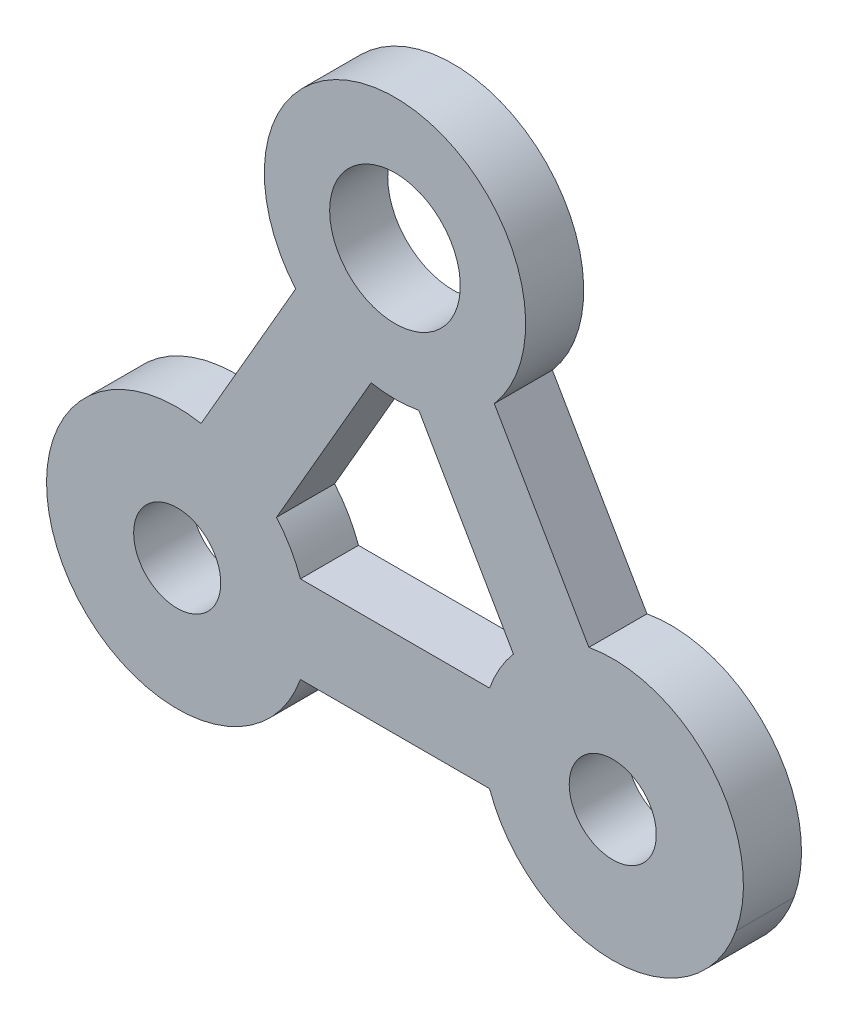
ISO-10303-21;
HEADER;
FILE_DESCRIPTION(('STEP AP214'),'2;1');
FILE_NAME('part.step','',(''),(''),'','','');
FILE_SCHEMA(('AUTOMOTIVE_DESIGN { 1 0 10303 214 1 1 1 1 }'));
ENDSEC;
DATA;
#1=APPLICATION_CONTEXT('core data for automotive mechanical design processes');
#2=APPLICATION_PROTOCOL_DEFINITION('international standard','automotive_design',2000,#1);
#3=PRODUCT_CONTEXT('',#1,'mechanical');
#4=PRODUCT('Part','Part','',(#3));
#5=PRODUCT_RELATED_PRODUCT_CATEGORY('part','',(#4));
#6=PRODUCT_DEFINITION_FORMATION('','',#4);
#7=PRODUCT_DEFINITION_CONTEXT('part definition',#1,'design');
#8=PRODUCT_DEFINITION('design','',#6,#7);
#9=PRODUCT_DEFINITION_SHAPE('','',#8);
#10=(LENGTH_UNIT() NAMED_UNIT(*) SI_UNIT(.MILLI.,.METRE.));
#11=(NAMED_UNIT(*) PLANE_ANGLE_UNIT() SI_UNIT($,.RADIAN.));
#12=(NAMED_UNIT(*) SI_UNIT($,.STERADIAN.) SOLID_ANGLE_UNIT());
#13=UNCERTAINTY_MEASURE_WITH_UNIT(LENGTH_MEASURE(1.E-05),#10,'distance_accuracy_value','');
#14=(GEOMETRIC_REPRESENTATION_CONTEXT(3) GLOBAL_UNCERTAINTY_ASSIGNED_CONTEXT((#13)) GLOBAL_UNIT_ASSIGNED_CONTEXT((#10,
#11,#12)) REPRESENTATION_CONTEXT('',''));
#15=CARTESIAN_POINT('',(0.,0.,0.));
#16=DIRECTION('',(0.,0.,1.));
#17=DIRECTION('',(1.,0.,0.));
#18=AXIS2_PLACEMENT_3D('',#15,#16,#17);
#19=CARTESIAN_POINT('',(-30.,-9.00000000000001,4.));
#20=DIRECTION('',(0.,1.,0.));
#21=DIRECTION('',(0.,0.,1.));
#22=AXIS2_PLACEMENT_3D('',#19,#20,#21);
#23=PLANE('',#22);
#24=DIRECTION('',(1.,0.,0.));
#25=VECTOR('',#24,1.);
#26=CARTESIAN_POINT('',(-30.,-9.00000000000001,0.));
#27=LINE('',#26,#25);
#28=CARTESIAN_POINT('',(0.,-9.00000000000001,0.));
#29=VERTEX_POINT('',#28);
#30=CARTESIAN_POINT('',(-0.0247566034555959,-9.00000000000001,0.));
#31=VERTEX_POINT('',#30);
#32=EDGE_CURVE('E178',#29,#31,#27,.F.);
#33=ORIENTED_EDGE('',*,*,#32,.F.);
#34=DIRECTION('',(0.,0.,-1.));
#35=VECTOR('',#34,1.);
#36=CARTESIAN_POINT('',(0.,-9.00000000000001,4.));
#37=LINE('',#36,#35);
#38=CARTESIAN_POINT('',(0.,-9.00000000000001,4.));
#39=VERTEX_POINT('',#38);
#40=EDGE_CURVE('E242',#39,#29,#37,.T.);
#41=ORIENTED_EDGE('',*,*,#40,.F.);
#42=DIRECTION('',(1.,0.,0.));
#43=VECTOR('',#42,1.);
#44=CARTESIAN_POINT('',(-30.,-9.00000000000001,4.));
#45=LINE('',#44,#43);
#46=CARTESIAN_POINT('',(-0.0247566034555959,-9.00000000000001,4.));
#47=VERTEX_POINT('',#46);
#48=EDGE_CURVE('E171',#47,#39,#45,.T.);
#49=ORIENTED_EDGE('',*,*,#48,.F.);
#50=DIRECTION('',(0.,0.,1.));
#51=VECTOR('',#50,1.);
#52=CARTESIAN_POINT('',(-0.024756603455596,-9.00000000000001,0.));
#53=LINE('',#52,#51);
#54=EDGE_CURVE('E246',#31,#47,#53,.T.);
#55=ORIENTED_EDGE('',*,*,#54,.F.);
#56=EDGE_LOOP('',(#33,#41,#49,#55));
#57=FACE_BOUND('',#56,.T.);
#58=ADVANCED_FACE('F16',(#57),#23,.F.);
#59=CARTESIAN_POINT('',(-37.7942250277826,4.50000624624988,4.));
#60=DIRECTION('',(0.866025003086951,-0.500000694027765,0.));
#61=DIRECTION('',(0.500000694027765,0.866025003086951,0.));
#62=AXIS2_PLACEMENT_3D('',#59,#60,#61);
#63=PLANE('',#62);
#64=DIRECTION('',(0.500000694027765,0.866025003086951,0.));
#65=VECTOR('',#64,1.);
#66=CARTESIAN_POINT('',(-37.7942250277826,4.50000624624988,0.));
#67=LINE('',#66,#65);
#68=CARTESIAN_POINT('',(-37.7942250277826,4.50000624624988,0.));
#69=VERTEX_POINT('',#68);
#70=CARTESIAN_POINT('',(-37.7789976871769,4.52638072503059,0.));
#71=VERTEX_POINT('',#70);
#72=EDGE_CURVE('E176',#69,#71,#67,.T.);
#73=ORIENTED_EDGE('',*,*,#72,.F.);
#74=DIRECTION('',(0.,0.,-1.));
#75=VECTOR('',#74,1.);
#76=CARTESIAN_POINT('',(-37.7942250277826,4.50000624624988,4.));
#77=LINE('',#76,#75);
#78=CARTESIAN_POINT('',(-37.7942250277827,4.50000624624964,4.));
#79=VERTEX_POINT('',#78);
#80=EDGE_CURVE('E189',#79,#69,#77,.T.);
#81=ORIENTED_EDGE('',*,*,#80,.F.);
#82=DIRECTION('',(-0.500000694027711,-0.866025003086982,0.));
#83=VECTOR('',#82,1.);
#84=CARTESIAN_POINT('',(-37.7789976871771,4.52638072503039,4.));
#85=LINE('',#84,#83);
#86=CARTESIAN_POINT('',(-37.7789976871771,4.52638072503034,4.));
#87=VERTEX_POINT('',#86);
#88=EDGE_CURVE('E173',#87,#79,#85,.T.);
#89=ORIENTED_EDGE('',*,*,#88,.F.);
#90=DIRECTION('',(0.,0.,1.));
#91=VECTOR('',#90,1.);
#92=CARTESIAN_POINT('',(-37.7789976871771,4.52638072503039,0.));
#93=LINE('',#92,#91);
#94=EDGE_CURVE('E234',#71,#87,#93,.T.);
#95=ORIENTED_EDGE('',*,*,#94,.F.);
#96=EDGE_LOOP('',(#73,#81,#89,#95));
#97=FACE_BOUND('',#96,.T.);
#98=ADVANCED_FACE('F277',(#97),#63,.F.);
#99=CARTESIAN_POINT('',(-30.,0.,4.));
#100=DIRECTION('',(0.,0.,1.));
#101=DIRECTION('',(1.,0.,0.));
#102=AXIS2_PLACEMENT_3D('',#99,#100,#101);
#103=PLANE('',#102);
#104=DIRECTION('',(-0.499999305971914,0.86602580448137,0.));
#105=VECTOR('',#104,1.);
#106=CARTESIAN_POINT('',(-1.64456941146356,8.8484365298898,4.));
#107=LINE('',#106,#105);
#108=CARTESIAN_POINT('',(-8.15928161944296,20.1322699542444,4.));
#109=VERTEX_POINT('',#108);
#110=CARTESIAN_POINT('',(-1.64456941146356,8.8484365298898,4.));
#111=VERTEX_POINT('',#110);
#112=EDGE_CURVE('E179',#109,#111,#107,.F.);
#113=ORIENTED_EDGE('',*,*,#112,.F.);
#114=CARTESIAN_POINT('',(-14.9999583583052,25.9807861553324,4.));
#115=DIRECTION('',(0.,0.,-1.));
#116=DIRECTION('',(-1.,0.,0.));
#117=AXIS2_PLACEMENT_3D('',#114,#115,#116);
#118=CIRCLE('',#117,9.);
#119=CARTESIAN_POINT('',(-21.8406799437062,20.132322409097,4.));
#120=VERTEX_POINT('',#119);
#121=EDGE_CURVE('E170',#120,#109,#118,.T.);
#122=ORIENTED_EDGE('',*,*,#121,.F.);
#123=DIRECTION('',(-0.500000694027764,-0.866025003086951,0.));
#124=VECTOR('',#123,1.);
#125=CARTESIAN_POINT('',(-21.8406799437062,20.132322409097,4.));
#126=LINE('',#125,#124);
#127=CARTESIAN_POINT('',(-28.3554102372795,8.84849942646499,4.));
#128=VERTEX_POINT('',#127);
#129=EDGE_CURVE('E167',#128,#120,#126,.F.);
#130=ORIENTED_EDGE('',*,*,#129,.F.);
#131=CARTESIAN_POINT('',(-30.0000354724355,4.14909889813464E-05,4.));
#132=DIRECTION('',(0.,0.,1.));
#133=DIRECTION('',(1.,0.,0.));
#134=AXIS2_PLACEMENT_3D('',#131,#132,#133);
#135=CIRCLE('',#134,9.00000000000001);
#136=EDGE_CURVE('E232',#87,#128,#135,.F.);
#137=ORIENTED_EDGE('',*,*,#136,.F.);
#138=ORIENTED_EDGE('',*,*,#88,.T.);
#139=CARTESIAN_POINT('',(-30.,0.,4.));
#140=DIRECTION('',(0.,0.,-1.));
#141=DIRECTION('',(-1.,0.,0.));
#142=AXIS2_PLACEMENT_3D('',#139,#140,#141);
#143=CIRCLE('',#142,9.);
#144=CARTESIAN_POINT('',(-36.8407570570037,-5.84842225622046,4.));
#145=VERTEX_POINT('',#144);
#146=EDGE_CURVE('E250',#145,#79,#143,.T.);
#147=ORIENTED_EDGE('',*,*,#146,.F.);
#148=CARTESIAN_POINT('',(-30.0000354724355,4.14909889813464E-05,4.));
#149=DIRECTION('',(0.,0.,1.));
#150=DIRECTION('',(1.,0.,0.));
#151=AXIS2_PLACEMENT_3D('',#148,#149,#150);
#152=CIRCLE('',#151,9.00000000000001);
#153=CARTESIAN_POINT('',(-21.5147565023829,-2.99996530906719,4.));
#154=VERTEX_POINT('',#153);
#155=EDGE_CURVE('E187',#154,#145,#152,.F.);
#156=ORIENTED_EDGE('',*,*,#155,.F.);
#157=DIRECTION('',(0.999999999999679,-8.01394418211777E-07,0.));
#158=VECTOR('',#157,1.);
#159=CARTESIAN_POINT('',(-21.5147565023829,-2.99996530906719,4.));
#160=LINE('',#159,#158);
#161=CARTESIAN_POINT('',(-8.48531400083018,-2.99997575078969,4.));
#162=VERTEX_POINT('',#161);
#163=EDGE_CURVE('E184',#162,#154,#160,.F.);
#164=ORIENTED_EDGE('',*,*,#163,.F.);
#165=CARTESIAN_POINT('',(-1.20268119734035E-05,-3.40164016919553E-05,4.));
#166=DIRECTION('',(0.,0.,1.));
#167=DIRECTION('',(1.,0.,0.));
#168=AXIS2_PLACEMENT_3D('',#165,#166,#167);
#169=CIRCLE('',#168,9.);
#170=EDGE_CURVE('E244',#47,#162,#169,.F.);
#171=ORIENTED_EDGE('',*,*,#170,.F.);
#172=ORIENTED_EDGE('',*,*,#48,.T.);
#173=CARTESIAN_POINT('',(0.,0.,4.));
#174=DIRECTION('',(0.,0.,-1.));
#175=DIRECTION('',(-1.,0.,0.));
#176=AXIS2_PLACEMENT_3D('',#173,#174,#175);
#177=CIRCLE('',#176,9.00000000000001);
#178=CARTESIAN_POINT('',(8.48525985281786,-3.00006087107538,4.));
#179=VERTEX_POINT('',#178);
#180=EDGE_CURVE('E239',#179,#39,#177,.T.);
#181=ORIENTED_EDGE('',*,*,#180,.F.);
#182=CARTESIAN_POINT('',(-1.20268119734035E-05,-3.40164016919553E-05,4.));
#183=DIRECTION('',(0.,0.,1.));
#184=DIRECTION('',(1.,0.,0.));
#185=AXIS2_PLACEMENT_3D('',#182,#183,#184);
#186=CIRCLE('',#185,9.);
#187=EDGE_CURVE('E182',#111,#179,#186,.F.);
#188=ORIENTED_EDGE('',*,*,#187,.F.);
#189=EDGE_LOOP('',(#113,#122,#130,#137,#138,#147,#156,#164,#171,#172,#181,#188));
#190=FACE_BOUND('',#189,.T.);
#191=CARTESIAN_POINT('',(-30.0000354724355,4.14909889813464E-05,4.));
#192=DIRECTION('',(0.,0.,1.));
#193=DIRECTION('',(1.,0.,0.));
#194=AXIS2_PLACEMENT_3D('',#191,#192,#193);
#195=CIRCLE('',#194,9.00000000000001);
#196=CARTESIAN_POINT('',(-23.159278414599,5.84846374623532,4.));
#197=VERTEX_POINT('',#196);
#198=CARTESIAN_POINT('',(-21.5147516940164,3.00003469093089,4.));
#199=VERTEX_POINT('',#198);
#200=EDGE_CURVE('E158',#197,#199,#195,.F.);
#201=ORIENTED_EDGE('',*,*,#200,.F.);
#202=DIRECTION('',(-0.500000694027765,-0.866025003086951,0.));
#203=VECTOR('',#202,1.);
#204=CARTESIAN_POINT('',(-16.6445299251845,17.1323182449305,4.));
#205=LINE('',#204,#203);
#206=CARTESIAN_POINT('',(-16.6445299251845,17.1323182449305,4.));
#207=VERTEX_POINT('',#206);
#208=EDGE_CURVE('E191',#197,#207,#205,.F.);
#209=ORIENTED_EDGE('',*,*,#208,.T.);
#210=CARTESIAN_POINT('',(-14.9999583583052,25.9807861553324,4.));
#211=DIRECTION('',(0.,0.,1.));
#212=DIRECTION('',(1.,0.,0.));
#213=AXIS2_PLACEMENT_3D('',#210,#211,#212);
#214=CIRCLE('',#213,9.);
#215=CARTESIAN_POINT('',(-13.3554546421219,17.1323056345051,4.));
#216=VERTEX_POINT('',#215);
#217=EDGE_CURVE('E193',#216,#207,#214,.F.);
#218=ORIENTED_EDGE('',*,*,#217,.F.);
#219=DIRECTION('',(-0.499999305971914,0.86602580448137,0.));
#220=VECTOR('',#219,1.);
#221=CARTESIAN_POINT('',(-6.84072423835178,5.84844069405831,4.));
#222=LINE('',#221,#220);
#223=CARTESIAN_POINT('',(-6.84072423835178,5.84844069405831,4.));
#224=VERTEX_POINT('',#223);
#225=EDGE_CURVE('E145',#216,#224,#222,.F.);
#226=ORIENTED_EDGE('',*,*,#225,.T.);
#227=CARTESIAN_POINT('',(-1.20268119734035E-05,-3.40164016919553E-05,4.));
#228=DIRECTION('',(0.,0.,1.));
#229=DIRECTION('',(1.,0.,0.));
#230=AXIS2_PLACEMENT_3D('',#227,#228,#229);
#231=CIRCLE('',#230,9.);
#232=CARTESIAN_POINT('',(-8.48527280083181,3.00002424917922,4.));
#233=VERTEX_POINT('',#232);
#234=EDGE_CURVE('E138',#233,#224,#231,.F.);
#235=ORIENTED_EDGE('',*,*,#234,.F.);
#236=DIRECTION('',(0.999999999999679,-8.01394419053135E-07,0.));
#237=VECTOR('',#236,1.);
#238=CARTESIAN_POINT('',(-21.5147516940164,3.00003469093089,4.));
#239=LINE('',#238,#237);
#240=EDGE_CURVE('E142',#233,#199,#239,.F.);
#241=ORIENTED_EDGE('',*,*,#240,.T.);
#242=EDGE_LOOP('',(#201,#209,#218,#226,#235,#241));
#243=FACE_BOUND('',#242,.T.);
#244=CARTESIAN_POINT('',(-30.,0.,4.));
#245=DIRECTION('',(0.,0.,-1.));
#246=DIRECTION('',(-1.,0.,0.));
#247=AXIS2_PLACEMENT_3D('',#244,#245,#246);
#248=CIRCLE('',#247,3.);
#249=CARTESIAN_POINT('',(-33.,0.,4.));
#250=VERTEX_POINT('',#249);
#251=EDGE_CURVE('E151',#250,#250,#248,.T.);
#252=ORIENTED_EDGE('',*,*,#251,.T.);
#253=EDGE_LOOP('',(#252));
#254=FACE_BOUND('',#253,.T.);
#255=CARTESIAN_POINT('',(0.,0.,4.));
#256=DIRECTION('',(0.,0.,-1.));
#257=DIRECTION('',(-1.,0.,0.));
#258=AXIS2_PLACEMENT_3D('',#255,#256,#257);
#259=CIRCLE('',#258,3.);
#260=CARTESIAN_POINT('',(-3.,0.,4.));
#261=VERTEX_POINT('',#260);
#262=EDGE_CURVE('E256',#261,#261,#259,.T.);
#263=ORIENTED_EDGE('',*,*,#262,.T.);
#264=EDGE_LOOP('',(#263));
#265=FACE_BOUND('',#264,.T.);
#266=CARTESIAN_POINT('',(-14.9999583583052,25.9807861553324,4.));
#267=DIRECTION('',(0.,0.,-1.));
#268=DIRECTION('',(-1.,0.,0.));
#269=AXIS2_PLACEMENT_3D('',#266,#267,#268);
#270=CIRCLE('',#269,4.5);
#271=CARTESIAN_POINT('',(-19.4999583583052,25.9807861553324,4.));
#272=VERTEX_POINT('',#271);
#273=EDGE_CURVE('E19',#272,#272,#270,.T.);
#274=ORIENTED_EDGE('',*,*,#273,.T.);
#275=EDGE_LOOP('',(#274));
#276=FACE_BOUND('',#275,.T.);
#277=ADVANCED_FACE('F140',(#190,#243,#254,#265,#276),#103,.T.);
#278=CARTESIAN_POINT('',(-14.9999583583052,25.9807861553324,4.));
#279=DIRECTION('',(0.,0.,-1.));
#280=DIRECTION('',(-1.,0.,0.));
#281=AXIS2_PLACEMENT_3D('',#278,#279,#280);
#282=CYLINDRICAL_SURFACE('',#281,4.5);
#283=CARTESIAN_POINT('',(-14.9999583583052,25.9807861553324,0.));
#284=DIRECTION('',(0.,0.,-1.));
#285=DIRECTION('',(-1.,0.,0.));
#286=AXIS2_PLACEMENT_3D('',#283,#284,#285);
#287=CIRCLE('',#286,4.5);
#288=CARTESIAN_POINT('',(-19.4999583583052,25.9807861553324,0.));
#289=VERTEX_POINT('',#288);
#290=EDGE_CURVE('E229',#289,#289,#287,.T.);
#291=ORIENTED_EDGE('',*,*,#290,.T.);
#292=EDGE_LOOP('',(#291));
#293=FACE_BOUND('',#292,.T.);
#294=ORIENTED_EDGE('',*,*,#273,.F.);
#295=EDGE_LOOP('',(#294));
#296=FACE_BOUND('',#295,.T.);
#297=ADVANCED_FACE('F264',(#293,#296),#282,.F.);
#298=CARTESIAN_POINT('',(0.,0.,4.));
#299=DIRECTION('',(0.,0.,-1.));
#300=DIRECTION('',(-1.,0.,0.));
#301=AXIS2_PLACEMENT_3D('',#298,#299,#300);
#302=CYLINDRICAL_SURFACE('',#301,3.);
#303=CARTESIAN_POINT('',(0.,0.,0.));
#304=DIRECTION('',(0.,0.,-1.));
#305=DIRECTION('',(-1.,0.,0.));
#306=AXIS2_PLACEMENT_3D('',#303,#304,#305);
#307=CIRCLE('',#306,3.);
#308=CARTESIAN_POINT('',(-3.,0.,0.));
#309=VERTEX_POINT('',#308);
#310=EDGE_CURVE('E226',#309,#309,#307,.T.);
#311=ORIENTED_EDGE('',*,*,#310,.T.);
#312=EDGE_LOOP('',(#311));
#313=FACE_BOUND('',#312,.T.);
#314=ORIENTED_EDGE('',*,*,#262,.F.);
#315=EDGE_LOOP('',(#314));
#316=FACE_BOUND('',#315,.T.);
#317=ADVANCED_FACE('F266',(#313,#316),#302,.F.);
#318=CARTESIAN_POINT('',(-30.,0.,4.));
#319=DIRECTION('',(0.,0.,-1.));
#320=DIRECTION('',(-1.,0.,0.));
#321=AXIS2_PLACEMENT_3D('',#318,#319,#320);
#322=CYLINDRICAL_SURFACE('',#321,3.);
#323=CARTESIAN_POINT('',(-30.,0.,0.));
#324=DIRECTION('',(0.,0.,-1.));
#325=DIRECTION('',(-1.,0.,0.));
#326=AXIS2_PLACEMENT_3D('',#323,#324,#325);
#327=CIRCLE('',#326,3.);
#328=CARTESIAN_POINT('',(-33.,0.,0.));
#329=VERTEX_POINT('',#328);
#330=EDGE_CURVE('E223',#329,#329,#327,.T.);
#331=ORIENTED_EDGE('',*,*,#330,.T.);
#332=EDGE_LOOP('',(#331));
#333=FACE_BOUND('',#332,.T.);
#334=ORIENTED_EDGE('',*,*,#251,.F.);
#335=EDGE_LOOP('',(#334));
#336=FACE_BOUND('',#335,.T.);
#337=ADVANCED_FACE('F274',(#333,#336),#322,.F.);
#338=CARTESIAN_POINT('',(-1.20268119734035E-05,-3.40164016919553E-05,0.));
#339=DIRECTION('',(0.,0.,1.));
#340=DIRECTION('',(1.,0.,0.));
#341=AXIS2_PLACEMENT_3D('',#338,#339,#340);
#342=CYLINDRICAL_SURFACE('',#341,9.);
#343=CARTESIAN_POINT('',(-1.20268119734035E-05,-3.40164016919553E-05,0.));
#344=DIRECTION('',(0.,0.,1.));
#345=DIRECTION('',(1.,0.,0.));
#346=AXIS2_PLACEMENT_3D('',#343,#344,#345);
#347=CIRCLE('',#346,9.);
#348=CARTESIAN_POINT('',(-6.84072423835178,5.84844069405831,0.));
#349=VERTEX_POINT('',#348);
#350=CARTESIAN_POINT('',(-8.48527280083181,3.00002424917922,0.));
#351=VERTEX_POINT('',#350);
#352=EDGE_CURVE('E162',#349,#351,#347,.T.);
#353=ORIENTED_EDGE('',*,*,#352,.T.);
#354=DIRECTION('',(0.,0.,1.));
#355=VECTOR('',#354,1.);
#356=CARTESIAN_POINT('',(-8.48527280083181,3.00002424917922,0.));
#357=LINE('',#356,#355);
#358=EDGE_CURVE('E150',#351,#233,#357,.T.);
#359=ORIENTED_EDGE('',*,*,#358,.T.);
#360=ORIENTED_EDGE('',*,*,#234,.T.);
#361=DIRECTION('',(0.,0.,1.));
#362=VECTOR('',#361,1.);
#363=CARTESIAN_POINT('',(-6.84072423835178,5.8484406940583,0.));
#364=LINE('',#363,#362);
#365=EDGE_CURVE('E536',#224,#349,#364,.F.);
#366=ORIENTED_EDGE('',*,*,#365,.T.);
#367=EDGE_LOOP('',(#353,#359,#360,#366));
#368=FACE_BOUND('',#367,.T.);
#369=ADVANCED_FACE('F161',(#368),#342,.T.);
#370=CARTESIAN_POINT('',(-21.5147516940164,3.00003469093089,0.));
#371=DIRECTION('',(-8.01394419053135E-07,-0.999999999999679,0.));
#372=DIRECTION('',(0.999999999999679,-8.01394419053135E-07,0.));
#373=AXIS2_PLACEMENT_3D('',#370,#371,#372);
#374=PLANE('',#373);
#375=ORIENTED_EDGE('',*,*,#358,.F.);
#376=DIRECTION('',(-0.999999999999679,8.01394419053135E-07,0.));
#377=VECTOR('',#376,1.);
#378=CARTESIAN_POINT('',(-8.48527280083181,3.00002424917922,0.));
#379=LINE('',#378,#377);
#380=CARTESIAN_POINT('',(-21.5147516940164,3.00003469093089,0.));
#381=VERTEX_POINT('',#380);
#382=EDGE_CURVE('E221',#351,#381,#379,.T.);
#383=ORIENTED_EDGE('',*,*,#382,.T.);
#384=DIRECTION('',(0.,0.,1.));
#385=VECTOR('',#384,1.);
#386=CARTESIAN_POINT('',(-21.5147516940164,3.00003469093089,0.));
#387=LINE('',#386,#385);
#388=EDGE_CURVE('E157',#199,#381,#387,.F.);
#389=ORIENTED_EDGE('',*,*,#388,.F.);
#390=ORIENTED_EDGE('',*,*,#240,.F.);
#391=EDGE_LOOP('',(#375,#383,#389,#390));
#392=FACE_BOUND('',#391,.T.);
#393=ADVANCED_FACE('F154',(#392),#374,.F.);
#394=CARTESIAN_POINT('',(-30.0000354724355,4.14909889813464E-05,0.));
#395=DIRECTION('',(0.,0.,1.));
#396=DIRECTION('',(1.,0.,0.));
#397=AXIS2_PLACEMENT_3D('',#394,#395,#396);
#398=CYLINDRICAL_SURFACE('',#397,9.00000000000001);
#399=CARTESIAN_POINT('',(-30.0000354724355,4.14909889813464E-05,0.));
#400=DIRECTION('',(0.,0.,1.));
#401=DIRECTION('',(1.,0.,0.));
#402=AXIS2_PLACEMENT_3D('',#399,#400,#401);
#403=CIRCLE('',#402,9.00000000000001);
#404=CARTESIAN_POINT('',(-23.159278414599,5.84846374623532,0.));
#405=VERTEX_POINT('',#404);
#406=EDGE_CURVE('E218',#381,#405,#403,.T.);
#407=ORIENTED_EDGE('',*,*,#406,.T.);
#408=DIRECTION('',(0.,0.,1.));
#409=VECTOR('',#408,1.);
#410=CARTESIAN_POINT('',(-23.159278414599,5.84846374623532,0.));
#411=LINE('',#410,#409);
#412=EDGE_CURVE('E194',#405,#197,#411,.T.);
#413=ORIENTED_EDGE('',*,*,#412,.T.);
#414=ORIENTED_EDGE('',*,*,#200,.T.);
#415=ORIENTED_EDGE('',*,*,#388,.T.);
#416=EDGE_LOOP('',(#407,#413,#414,#415));
#417=FACE_BOUND('',#416,.T.);
#418=ADVANCED_FACE('F339',(#417),#398,.T.);
#419=CARTESIAN_POINT('',(-16.6445299251845,17.1323182449305,0.));
#420=DIRECTION('',(-0.866025003086951,0.500000694027765,0.));
#421=DIRECTION('',(-0.500000694027765,-0.866025003086951,0.));
#422=AXIS2_PLACEMENT_3D('',#419,#420,#421);
#423=PLANE('',#422);
#424=ORIENTED_EDGE('',*,*,#412,.F.);
#425=DIRECTION('',(0.500000694027765,0.866025003086951,0.));
#426=VECTOR('',#425,1.);
#427=CARTESIAN_POINT('',(-23.159278414599,5.84846374623532,0.));
#428=LINE('',#427,#426);
#429=CARTESIAN_POINT('',(-16.6445299251845,17.1323182449305,0.));
#430=VERTEX_POINT('',#429);
#431=EDGE_CURVE('E217',#405,#430,#428,.T.);
#432=ORIENTED_EDGE('',*,*,#431,.T.);
#433=DIRECTION('',(0.,0.,1.));
#434=VECTOR('',#433,1.);
#435=CARTESIAN_POINT('',(-16.6445299251845,17.1323182449305,0.));
#436=LINE('',#435,#434);
#437=EDGE_CURVE('E253',#207,#430,#436,.F.);
#438=ORIENTED_EDGE('',*,*,#437,.F.);
#439=ORIENTED_EDGE('',*,*,#208,.F.);
#440=EDGE_LOOP('',(#424,#432,#438,#439));
#441=FACE_BOUND('',#440,.T.);
#442=ADVANCED_FACE('F335',(#441),#423,.F.);
#443=CARTESIAN_POINT('',(-14.9999583583052,25.9807861553324,0.));
#444=DIRECTION('',(0.,0.,1.));
#445=DIRECTION('',(1.,0.,0.));
#446=AXIS2_PLACEMENT_3D('',#443,#444,#445);
#447=CYLINDRICAL_SURFACE('',#446,9.);
#448=CARTESIAN_POINT('',(-14.9999583583052,25.9807861553324,0.));
#449=DIRECTION('',(0.,0.,1.));
#450=DIRECTION('',(1.,0.,0.));
#451=AXIS2_PLACEMENT_3D('',#448,#449,#450);
#452=CIRCLE('',#451,9.);
#453=CARTESIAN_POINT('',(-13.3554546421219,17.1323056345051,0.));
#454=VERTEX_POINT('',#453);
#455=EDGE_CURVE('E214',#430,#454,#452,.T.);
#456=ORIENTED_EDGE('',*,*,#455,.T.);
#457=DIRECTION('',(0.,0.,1.));
#458=VECTOR('',#457,1.);
#459=CARTESIAN_POINT('',(-13.3554546421219,17.1323056345051,0.));
#460=LINE('',#459,#458);
#461=EDGE_CURVE('E190',#454,#216,#460,.T.);
#462=ORIENTED_EDGE('',*,*,#461,.T.);
#463=ORIENTED_EDGE('',*,*,#217,.T.);
#464=ORIENTED_EDGE('',*,*,#437,.T.);
#465=EDGE_LOOP('',(#456,#462,#463,#464));
#466=FACE_BOUND('',#465,.T.);
#467=ADVANCED_FACE('F331',(#466),#447,.T.);
#468=CARTESIAN_POINT('',(-6.84072423835178,5.84844069405831,0.));
#469=DIRECTION('',(0.86602580448137,0.499999305971914,0.));
#470=DIRECTION('',(-0.499999305971914,0.86602580448137,0.));
#471=AXIS2_PLACEMENT_3D('',#468,#469,#470);
#472=PLANE('',#471);
#473=ORIENTED_EDGE('',*,*,#461,.F.);
#474=DIRECTION('',(0.499999305971914,-0.86602580448137,0.));
#475=VECTOR('',#474,1.);
#476=CARTESIAN_POINT('',(-13.3554546421219,17.1323056345051,0.));
#477=LINE('',#476,#475);
#478=EDGE_CURVE('E213',#454,#349,#477,.T.);
#479=ORIENTED_EDGE('',*,*,#478,.T.);
#480=ORIENTED_EDGE('',*,*,#365,.F.);
#481=ORIENTED_EDGE('',*,*,#225,.F.);
#482=EDGE_LOOP('',(#473,#479,#480,#481));
#483=FACE_BOUND('',#482,.T.);
#484=ADVANCED_FACE('F327',(#483),#472,.F.);
#485=CARTESIAN_POINT('',(-30.,0.,4.));
#486=DIRECTION('',(0.,0.,-1.));
#487=DIRECTION('',(-1.,0.,0.));
#488=AXIS2_PLACEMENT_3D('',#485,#486,#487);
#489=CYLINDRICAL_SURFACE('',#488,9.);
#490=CARTESIAN_POINT('',(-30.,0.,0.));
#491=DIRECTION('',(0.,0.,-1.));
#492=DIRECTION('',(-1.,0.,0.));
#493=AXIS2_PLACEMENT_3D('',#490,#491,#492);
#494=CIRCLE('',#493,9.);
#495=CARTESIAN_POINT('',(-36.8407570570037,-5.84842225622046,0.));
#496=VERTEX_POINT('',#495);
#497=EDGE_CURVE('E211',#69,#496,#494,.F.);
#498=ORIENTED_EDGE('',*,*,#497,.T.);
#499=DIRECTION('',(0.,0.,1.));
#500=VECTOR('',#499,1.);
#501=CARTESIAN_POINT('',(-36.8407570570037,-5.84842225622045,0.));
#502=LINE('',#501,#500);
#503=EDGE_CURVE('E249',#145,#496,#502,.F.);
#504=ORIENTED_EDGE('',*,*,#503,.F.);
#505=ORIENTED_EDGE('',*,*,#146,.T.);
#506=ORIENTED_EDGE('',*,*,#80,.T.);
#507=EDGE_LOOP('',(#498,#504,#505,#506));
#508=FACE_BOUND('',#507,.T.);
#509=ADVANCED_FACE('F323',(#508),#489,.T.);
#510=CARTESIAN_POINT('',(-30.0000354724355,4.14909889813464E-05,0.));
#511=DIRECTION('',(0.,0.,1.));
#512=DIRECTION('',(1.,0.,0.));
#513=AXIS2_PLACEMENT_3D('',#510,#511,#512);
#514=CYLINDRICAL_SURFACE('',#513,9.00000000000001);
#515=DIRECTION('',(0.,0.,1.));
#516=VECTOR('',#515,1.);
#517=CARTESIAN_POINT('',(-21.5147565023829,-2.99996530906719,0.));
#518=LINE('',#517,#516);
#519=CARTESIAN_POINT('',(-21.5147565023829,-2.99996530906719,0.));
#520=VERTEX_POINT('',#519);
#521=EDGE_CURVE('E186',#154,#520,#518,.F.);
#522=ORIENTED_EDGE('',*,*,#521,.F.);
#523=ORIENTED_EDGE('',*,*,#155,.T.);
#524=ORIENTED_EDGE('',*,*,#503,.T.);
#525=CARTESIAN_POINT('',(-30.0000354724355,4.14909889813464E-05,0.));
#526=DIRECTION('',(0.,0.,1.));
#527=DIRECTION('',(1.,0.,0.));
#528=AXIS2_PLACEMENT_3D('',#525,#526,#527);
#529=CIRCLE('',#528,9.00000000000001);
#530=EDGE_CURVE('E208',#496,#520,#529,.T.);
#531=ORIENTED_EDGE('',*,*,#530,.T.);
#532=EDGE_LOOP('',(#522,#523,#524,#531));
#533=FACE_BOUND('',#532,.T.);
#534=ADVANCED_FACE('F319',(#533),#514,.T.);
#535=CARTESIAN_POINT('',(-21.5147565023829,-2.99996530906719,0.));
#536=DIRECTION('',(-8.01394418211777E-07,-0.999999999999679,0.));
#537=DIRECTION('',(0.999999999999679,-8.01394418211777E-07,0.));
#538=AXIS2_PLACEMENT_3D('',#535,#536,#537);
#539=PLANE('',#538);
#540=DIRECTION('',(0.999999999999679,-8.01394418311631E-07,0.));
#541=VECTOR('',#540,1.);
#542=CARTESIAN_POINT('',(-21.5147565023829,-2.99996530906719,0.));
#543=LINE('',#542,#541);
#544=CARTESIAN_POINT('',(-8.48531400083018,-2.99997575078969,0.));
#545=VERTEX_POINT('',#544);
#546=EDGE_CURVE('E207',#520,#545,#543,.T.);
#547=ORIENTED_EDGE('',*,*,#546,.T.);
#548=DIRECTION('',(0.,0.,1.));
#549=VECTOR('',#548,1.);
#550=CARTESIAN_POINT('',(-8.48531400083018,-2.99997575078969,0.));
#551=LINE('',#550,#549);
#552=EDGE_CURVE('E243',#162,#545,#551,.F.);
#553=ORIENTED_EDGE('',*,*,#552,.F.);
#554=ORIENTED_EDGE('',*,*,#163,.T.);
#555=ORIENTED_EDGE('',*,*,#521,.T.);
#556=EDGE_LOOP('',(#547,#553,#554,#555));
#557=FACE_BOUND('',#556,.T.);
#558=ADVANCED_FACE('F315',(#557),#539,.T.);
#559=CARTESIAN_POINT('',(-1.20268119734035E-05,-3.40164016919553E-05,0.));
#560=DIRECTION('',(0.,0.,1.));
#561=DIRECTION('',(1.,0.,0.));
#562=AXIS2_PLACEMENT_3D('',#559,#560,#561);
#563=CYLINDRICAL_SURFACE('',#562,9.);
#564=ORIENTED_EDGE('',*,*,#552,.T.);
#565=CARTESIAN_POINT('',(-1.20268119734035E-05,-3.40164016919553E-05,0.));
#566=DIRECTION('',(0.,0.,1.));
#567=DIRECTION('',(1.,0.,0.));
#568=AXIS2_PLACEMENT_3D('',#565,#566,#567);
#569=CIRCLE('',#568,9.);
#570=EDGE_CURVE('E204',#545,#31,#569,.T.);
#571=ORIENTED_EDGE('',*,*,#570,.T.);
#572=ORIENTED_EDGE('',*,*,#54,.T.);
#573=ORIENTED_EDGE('',*,*,#170,.T.);
#574=EDGE_LOOP('',(#564,#571,#572,#573));
#575=FACE_BOUND('',#574,.T.);
#576=ADVANCED_FACE('F311',(#575),#563,.T.);
#577=CARTESIAN_POINT('',(0.,0.,4.));
#578=DIRECTION('',(0.,0.,-1.));
#579=DIRECTION('',(-1.,0.,0.));
#580=AXIS2_PLACEMENT_3D('',#577,#578,#579);
#581=CYLINDRICAL_SURFACE('',#580,9.00000000000001);
#582=ORIENTED_EDGE('',*,*,#40,.T.);
#583=CARTESIAN_POINT('',(0.,0.,0.));
#584=DIRECTION('',(0.,0.,-1.));
#585=DIRECTION('',(-1.,0.,0.));
#586=AXIS2_PLACEMENT_3D('',#583,#584,#585);
#587=CIRCLE('',#586,9.00000000000001);
#588=CARTESIAN_POINT('',(8.48525985281786,-3.00006087107538,0.));
#589=VERTEX_POINT('',#588);
#590=EDGE_CURVE('E201',#29,#589,#587,.F.);
#591=ORIENTED_EDGE('',*,*,#590,.T.);
#592=DIRECTION('',(0.,0.,1.));
#593=VECTOR('',#592,1.);
#594=CARTESIAN_POINT('',(8.48525985281785,-3.00006087107538,0.));
#595=LINE('',#594,#593);
#596=EDGE_CURVE('E238',#179,#589,#595,.F.);
#597=ORIENTED_EDGE('',*,*,#596,.F.);
#598=ORIENTED_EDGE('',*,*,#180,.T.);
#599=EDGE_LOOP('',(#582,#591,#597,#598));
#600=FACE_BOUND('',#599,.T.);
#601=ADVANCED_FACE('F307',(#600),#581,.T.);
#602=CARTESIAN_POINT('',(-1.20268119734035E-05,-3.40164016919553E-05,0.));
#603=DIRECTION('',(0.,0.,1.));
#604=DIRECTION('',(1.,0.,0.));
#605=AXIS2_PLACEMENT_3D('',#602,#603,#604);
#606=CYLINDRICAL_SURFACE('',#605,9.);
#607=DIRECTION('',(0.,0.,1.));
#608=VECTOR('',#607,1.);
#609=CARTESIAN_POINT('',(-1.64456941146356,8.8484365298898,0.));
#610=LINE('',#609,#608);
#611=CARTESIAN_POINT('',(-1.64456941146356,8.8484365298898,0.));
#612=VERTEX_POINT('',#611);
#613=EDGE_CURVE('E181',#111,#612,#610,.F.);
#614=ORIENTED_EDGE('',*,*,#613,.F.);
#615=ORIENTED_EDGE('',*,*,#187,.T.);
#616=ORIENTED_EDGE('',*,*,#596,.T.);
#617=CARTESIAN_POINT('',(-1.20268119734035E-05,-3.40164016919553E-05,0.));
#618=DIRECTION('',(0.,0.,1.));
#619=DIRECTION('',(1.,0.,0.));
#620=AXIS2_PLACEMENT_3D('',#617,#618,#619);
#621=CIRCLE('',#620,9.);
#622=EDGE_CURVE('E199',#589,#612,#621,.T.);
#623=ORIENTED_EDGE('',*,*,#622,.T.);
#624=EDGE_LOOP('',(#614,#615,#616,#623));
#625=FACE_BOUND('',#624,.T.);
#626=ADVANCED_FACE('F303',(#625),#606,.T.);
#627=CARTESIAN_POINT('',(-1.64456941146356,8.8484365298898,0.));
#628=DIRECTION('',(0.86602580448137,0.499999305971914,0.));
#629=DIRECTION('',(-0.499999305971914,0.86602580448137,0.));
#630=AXIS2_PLACEMENT_3D('',#627,#628,#629);
#631=PLANE('',#630);
#632=DIRECTION('',(-0.499999305971914,0.86602580448137,0.));
#633=VECTOR('',#632,1.);
#634=CARTESIAN_POINT('',(-1.64456941146356,8.8484365298898,0.));
#635=LINE('',#634,#633);
#636=CARTESIAN_POINT('',(-8.15928161944296,20.1322699542443,0.));
#637=VERTEX_POINT('',#636);
#638=EDGE_CURVE('E198',#612,#637,#635,.T.);
#639=ORIENTED_EDGE('',*,*,#638,.T.);
#640=DIRECTION('',(0.,0.,-1.));
#641=VECTOR('',#640,1.);
#642=CARTESIAN_POINT('',(-8.15928161944296,20.1322699542444,4.));
#643=LINE('',#642,#641);
#644=EDGE_CURVE('E236',#109,#637,#643,.T.);
#645=ORIENTED_EDGE('',*,*,#644,.F.);
#646=ORIENTED_EDGE('',*,*,#112,.T.);
#647=ORIENTED_EDGE('',*,*,#613,.T.);
#648=EDGE_LOOP('',(#639,#645,#646,#647));
#649=FACE_BOUND('',#648,.T.);
#650=ADVANCED_FACE('F299',(#649),#631,.T.);
#651=CARTESIAN_POINT('',(-14.9999583583052,25.9807861553324,4.));
#652=DIRECTION('',(0.,0.,-1.));
#653=DIRECTION('',(-1.,0.,0.));
#654=AXIS2_PLACEMENT_3D('',#651,#652,#653);
#655=CYLINDRICAL_SURFACE('',#654,9.);
#656=CARTESIAN_POINT('',(-14.9999583583052,25.9807861553324,0.));
#657=DIRECTION('',(0.,0.,-1.));
#658=DIRECTION('',(-1.,0.,0.));
#659=AXIS2_PLACEMENT_3D('',#656,#657,#658);
#660=CIRCLE('',#659,9.);
#661=CARTESIAN_POINT('',(-21.8406799437062,20.132322409097,0.));
#662=VERTEX_POINT('',#661);
#663=EDGE_CURVE('E196',#637,#662,#660,.F.);
#664=ORIENTED_EDGE('',*,*,#663,.T.);
#665=DIRECTION('',(0.,0.,1.));
#666=VECTOR('',#665,1.);
#667=CARTESIAN_POINT('',(-21.8406799437062,20.132322409097,0.));
#668=LINE('',#667,#666);
#669=EDGE_CURVE('E169',#120,#662,#668,.F.);
#670=ORIENTED_EDGE('',*,*,#669,.F.);
#671=ORIENTED_EDGE('',*,*,#121,.T.);
#672=ORIENTED_EDGE('',*,*,#644,.T.);
#673=EDGE_LOOP('',(#664,#670,#671,#672));
#674=FACE_BOUND('',#673,.T.);
#675=ADVANCED_FACE('F295',(#674),#655,.T.);
#676=CARTESIAN_POINT('',(-21.8406799437062,20.132322409097,0.));
#677=DIRECTION('',(-0.866025003086951,0.500000694027764,0.));
#678=DIRECTION('',(-0.500000694027764,-0.866025003086951,0.));
#679=AXIS2_PLACEMENT_3D('',#676,#677,#678);
#680=PLANE('',#679);
#681=DIRECTION('',(-0.500000694027764,-0.866025003086951,0.));
#682=VECTOR('',#681,1.);
#683=CARTESIAN_POINT('',(-21.8406799437062,20.132322409097,0.));
#684=LINE('',#683,#682);
#685=CARTESIAN_POINT('',(-28.3554102372795,8.84849942646499,0.));
#686=VERTEX_POINT('',#685);
#687=EDGE_CURVE('E25',#662,#686,#684,.T.);
#688=ORIENTED_EDGE('',*,*,#687,.T.);
#689=DIRECTION('',(0.,0.,1.));
#690=VECTOR('',#689,1.);
#691=CARTESIAN_POINT('',(-28.3554102372795,8.84849942646499,0.));
#692=LINE('',#691,#690);
#693=EDGE_CURVE('E33',#128,#686,#692,.F.);
#694=ORIENTED_EDGE('',*,*,#693,.F.);
#695=ORIENTED_EDGE('',*,*,#129,.T.);
#696=ORIENTED_EDGE('',*,*,#669,.T.);
#697=EDGE_LOOP('',(#688,#694,#695,#696));
#698=FACE_BOUND('',#697,.T.);
#699=ADVANCED_FACE('F288',(#698),#680,.T.);
#700=CARTESIAN_POINT('',(-30.0000354724355,4.14909889813464E-05,0.));
#701=DIRECTION('',(0.,0.,1.));
#702=DIRECTION('',(1.,0.,0.));
#703=AXIS2_PLACEMENT_3D('',#700,#701,#702);
#704=CYLINDRICAL_SURFACE('',#703,9.00000000000001);
#705=ORIENTED_EDGE('',*,*,#693,.T.);
#706=CARTESIAN_POINT('',(-30.0000354724355,4.14909889813464E-05,0.));
#707=DIRECTION('',(0.,0.,1.));
#708=DIRECTION('',(1.,0.,0.));
#709=AXIS2_PLACEMENT_3D('',#706,#707,#708);
#710=CIRCLE('',#709,9.00000000000001);
#711=EDGE_CURVE('E10',#686,#71,#710,.T.);
#712=ORIENTED_EDGE('',*,*,#711,.T.);
#713=ORIENTED_EDGE('',*,*,#94,.T.);
#714=ORIENTED_EDGE('',*,*,#136,.T.);
#715=EDGE_LOOP('',(#705,#712,#713,#714));
#716=FACE_BOUND('',#715,.T.);
#717=ADVANCED_FACE('F282',(#716),#704,.T.);
#718=CARTESIAN_POINT('',(-30.,0.,0.));
#719=DIRECTION('',(0.,0.,1.));
#720=DIRECTION('',(1.,0.,0.));
#721=AXIS2_PLACEMENT_3D('',#718,#719,#720);
#722=PLANE('',#721);
#723=ORIENTED_EDGE('',*,*,#687,.F.);
#724=ORIENTED_EDGE('',*,*,#663,.F.);
#725=ORIENTED_EDGE('',*,*,#638,.F.);
#726=ORIENTED_EDGE('',*,*,#622,.F.);
#727=ORIENTED_EDGE('',*,*,#590,.F.);
#728=ORIENTED_EDGE('',*,*,#32,.T.);
#729=ORIENTED_EDGE('',*,*,#570,.F.);
#730=ORIENTED_EDGE('',*,*,#546,.F.);
#731=ORIENTED_EDGE('',*,*,#530,.F.);
#732=ORIENTED_EDGE('',*,*,#497,.F.);
#733=ORIENTED_EDGE('',*,*,#72,.T.);
#734=ORIENTED_EDGE('',*,*,#711,.F.);
#735=EDGE_LOOP('',(#723,#724,#725,#726,#727,#728,#729,#730,#731,#732,#733,#734));
#736=FACE_BOUND('',#735,.T.);
#737=ORIENTED_EDGE('',*,*,#455,.F.);
#738=ORIENTED_EDGE('',*,*,#431,.F.);
#739=ORIENTED_EDGE('',*,*,#406,.F.);
#740=ORIENTED_EDGE('',*,*,#382,.F.);
#741=ORIENTED_EDGE('',*,*,#352,.F.);
#742=ORIENTED_EDGE('',*,*,#478,.F.);
#743=EDGE_LOOP('',(#737,#738,#739,#740,#741,#742));
#744=FACE_BOUND('',#743,.T.);
#745=ORIENTED_EDGE('',*,*,#330,.F.);
#746=EDGE_LOOP('',(#745));
#747=FACE_BOUND('',#746,.T.);
#748=ORIENTED_EDGE('',*,*,#310,.F.);
#749=EDGE_LOOP('',(#748));
#750=FACE_BOUND('',#749,.T.);
#751=ORIENTED_EDGE('',*,*,#290,.F.);
#752=EDGE_LOOP('',(#751));
#753=FACE_BOUND('',#752,.T.);
#754=ADVANCED_FACE('F280',(#736,#744,#747,#750,#753),#722,.F.);
#755=CLOSED_SHELL('',(#58,#98,#277,#297,#317,#337,#369,#393,#418,#442,#467,#484,#509,#534,#558,
#576,#601,#626,#650,#675,#699,#717,#754));
#756=MANIFOLD_SOLID_BREP('B1',#755);
#757=ADVANCED_BREP_SHAPE_REPRESENTATION('',(#18,#756),#14);
#758=SHAPE_DEFINITION_REPRESENTATION(#9,#757);
ENDSEC;
END-ISO-10303-21;
